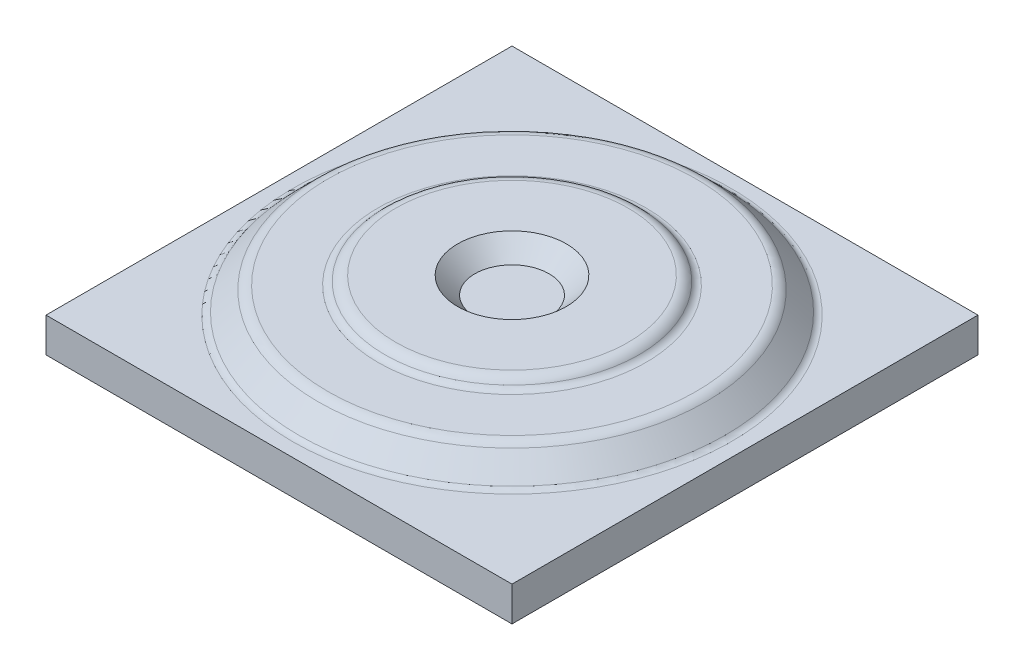
ISO-10303-21;
HEADER;
FILE_DESCRIPTION(('STEP AP214'),'2;1');
FILE_NAME('part.step','',(''),(''),'','','');
FILE_SCHEMA(('AUTOMOTIVE_DESIGN { 1 0 10303 214 1 1 1 1 }'));
ENDSEC;
DATA;
#1=APPLICATION_CONTEXT('core data for automotive mechanical design processes');
#2=APPLICATION_PROTOCOL_DEFINITION('international standard','automotive_design',2000,#1);
#3=PRODUCT_CONTEXT('',#1,'mechanical');
#4=PRODUCT('Part','Part','',(#3));
#5=PRODUCT_RELATED_PRODUCT_CATEGORY('part','',(#4));
#6=PRODUCT_DEFINITION_FORMATION('','',#4);
#7=PRODUCT_DEFINITION_CONTEXT('part definition',#1,'design');
#8=PRODUCT_DEFINITION('design','',#6,#7);
#9=PRODUCT_DEFINITION_SHAPE('','',#8);
#10=(LENGTH_UNIT() NAMED_UNIT(*) SI_UNIT(.MILLI.,.METRE.));
#11=(NAMED_UNIT(*) PLANE_ANGLE_UNIT() SI_UNIT($,.RADIAN.));
#12=(NAMED_UNIT(*) SI_UNIT($,.STERADIAN.) SOLID_ANGLE_UNIT());
#13=UNCERTAINTY_MEASURE_WITH_UNIT(LENGTH_MEASURE(1.E-05),#10,'distance_accuracy_value','');
#14=(GEOMETRIC_REPRESENTATION_CONTEXT(3) GLOBAL_UNCERTAINTY_ASSIGNED_CONTEXT((#13)) GLOBAL_UNIT_ASSIGNED_CONTEXT((#10,
#11,#12)) REPRESENTATION_CONTEXT('',''));
#15=CARTESIAN_POINT('',(0.,0.,0.));
#16=DIRECTION('',(0.,0.,1.));
#17=DIRECTION('',(1.,0.,0.));
#18=AXIS2_PLACEMENT_3D('',#15,#16,#17);
#19=CARTESIAN_POINT('',(-135.,20.,135.));
#20=DIRECTION('',(1.,0.,0.));
#21=DIRECTION('',(0.,0.,-1.));
#22=AXIS2_PLACEMENT_3D('',#19,#20,#21);
#23=PLANE('',#22);
#24=DIRECTION('',(0.,0.,1.));
#25=VECTOR('',#24,1.);
#26=CARTESIAN_POINT('',(-135.,0.,135.));
#27=LINE('',#26,#25);
#28=CARTESIAN_POINT('',(-135.,0.,-135.));
#29=VERTEX_POINT('',#28);
#30=CARTESIAN_POINT('',(-135.,0.,135.));
#31=VERTEX_POINT('',#30);
#32=EDGE_CURVE('E106',#29,#31,#27,.T.);
#33=ORIENTED_EDGE('',*,*,#32,.T.);
#34=DIRECTION('',(0.,-1.,0.));
#35=VECTOR('',#34,1.);
#36=CARTESIAN_POINT('',(-135.,20.,135.));
#37=LINE('',#36,#35);
#38=CARTESIAN_POINT('',(-135.,20.,135.));
#39=VERTEX_POINT('',#38);
#40=EDGE_CURVE('E97',#39,#31,#37,.T.);
#41=ORIENTED_EDGE('',*,*,#40,.F.);
#42=DIRECTION('',(0.,0.,1.));
#43=VECTOR('',#42,1.);
#44=CARTESIAN_POINT('',(-135.,20.,135.));
#45=LINE('',#44,#43);
#46=CARTESIAN_POINT('',(-135.,20.,-135.));
#47=VERTEX_POINT('',#46);
#48=EDGE_CURVE('E91',#47,#39,#45,.T.);
#49=ORIENTED_EDGE('',*,*,#48,.F.);
#50=DIRECTION('',(0.,-1.,0.));
#51=VECTOR('',#50,1.);
#52=CARTESIAN_POINT('',(-135.,20.,-135.));
#53=LINE('',#52,#51);
#54=EDGE_CURVE('E102',#47,#29,#53,.T.);
#55=ORIENTED_EDGE('',*,*,#54,.T.);
#56=EDGE_LOOP('',(#33,#41,#49,#55));
#57=FACE_BOUND('',#56,.T.);
#58=ADVANCED_FACE('F38',(#57),#23,.F.);
#59=CARTESIAN_POINT('',(135.,20.,135.));
#60=DIRECTION('',(0.,0.,-1.));
#61=DIRECTION('',(-1.,0.,0.));
#62=AXIS2_PLACEMENT_3D('',#59,#60,#61);
#63=PLANE('',#62);
#64=DIRECTION('',(1.,0.,0.));
#65=VECTOR('',#64,1.);
#66=CARTESIAN_POINT('',(135.,0.,135.));
#67=LINE('',#66,#65);
#68=CARTESIAN_POINT('',(135.,0.,135.));
#69=VERTEX_POINT('',#68);
#70=EDGE_CURVE('E96',#31,#69,#67,.T.);
#71=ORIENTED_EDGE('',*,*,#70,.T.);
#72=DIRECTION('',(0.,-1.,0.));
#73=VECTOR('',#72,1.);
#74=CARTESIAN_POINT('',(135.,20.,135.));
#75=LINE('',#74,#73);
#76=CARTESIAN_POINT('',(135.,20.,135.));
#77=VERTEX_POINT('',#76);
#78=EDGE_CURVE('E94',#77,#69,#75,.T.);
#79=ORIENTED_EDGE('',*,*,#78,.F.);
#80=DIRECTION('',(1.,0.,0.));
#81=VECTOR('',#80,1.);
#82=CARTESIAN_POINT('',(135.,20.,135.));
#83=LINE('',#82,#81);
#84=EDGE_CURVE('E86',#39,#77,#83,.T.);
#85=ORIENTED_EDGE('',*,*,#84,.F.);
#86=ORIENTED_EDGE('',*,*,#40,.T.);
#87=EDGE_LOOP('',(#71,#79,#85,#86));
#88=FACE_BOUND('',#87,.T.);
#89=ADVANCED_FACE('F95',(#88),#63,.F.);
#90=CARTESIAN_POINT('',(135.,20.,135.));
#91=DIRECTION('',(-1.,0.,0.));
#92=DIRECTION('',(0.,0.,1.));
#93=AXIS2_PLACEMENT_3D('',#90,#91,#92);
#94=PLANE('',#93);
#95=DIRECTION('',(0.,0.,-1.));
#96=VECTOR('',#95,1.);
#97=CARTESIAN_POINT('',(135.,0.,135.));
#98=LINE('',#97,#96);
#99=CARTESIAN_POINT('',(135.,0.,-135.));
#100=VERTEX_POINT('',#99);
#101=EDGE_CURVE('E72',#69,#100,#98,.T.);
#102=ORIENTED_EDGE('',*,*,#101,.T.);
#103=DIRECTION('',(0.,-1.,0.));
#104=VECTOR('',#103,1.);
#105=CARTESIAN_POINT('',(135.,20.,-135.));
#106=LINE('',#105,#104);
#107=CARTESIAN_POINT('',(135.,20.,-135.));
#108=VERTEX_POINT('',#107);
#109=EDGE_CURVE('E98',#108,#100,#106,.T.);
#110=ORIENTED_EDGE('',*,*,#109,.F.);
#111=DIRECTION('',(0.,0.,-1.));
#112=VECTOR('',#111,1.);
#113=CARTESIAN_POINT('',(135.,20.,135.));
#114=LINE('',#113,#112);
#115=EDGE_CURVE('E89',#77,#108,#114,.T.);
#116=ORIENTED_EDGE('',*,*,#115,.F.);
#117=ORIENTED_EDGE('',*,*,#78,.T.);
#118=EDGE_LOOP('',(#102,#110,#116,#117));
#119=FACE_BOUND('',#118,.T.);
#120=ADVANCED_FACE('F100',(#119),#94,.F.);
#121=CARTESIAN_POINT('',(135.,20.,-135.));
#122=DIRECTION('',(0.,0.,1.));
#123=DIRECTION('',(1.,0.,0.));
#124=AXIS2_PLACEMENT_3D('',#121,#122,#123);
#125=PLANE('',#124);
#126=DIRECTION('',(-1.,0.,0.));
#127=VECTOR('',#126,1.);
#128=CARTESIAN_POINT('',(135.,0.,-135.));
#129=LINE('',#128,#127);
#130=EDGE_CURVE('E78',#100,#29,#129,.T.);
#131=ORIENTED_EDGE('',*,*,#130,.T.);
#132=ORIENTED_EDGE('',*,*,#54,.F.);
#133=DIRECTION('',(-1.,0.,0.));
#134=VECTOR('',#133,1.);
#135=CARTESIAN_POINT('',(135.,20.,-135.));
#136=LINE('',#135,#134);
#137=EDGE_CURVE('E55',#108,#47,#136,.T.);
#138=ORIENTED_EDGE('',*,*,#137,.F.);
#139=ORIENTED_EDGE('',*,*,#109,.T.);
#140=EDGE_LOOP('',(#131,#132,#138,#139));
#141=FACE_BOUND('',#140,.T.);
#142=ADVANCED_FACE('F191',(#141),#125,.F.);
#143=CARTESIAN_POINT('',(0.,20.,0.));
#144=DIRECTION('',(0.,1.,0.));
#145=DIRECTION('',(0.,0.,1.));
#146=AXIS2_PLACEMENT_3D('',#143,#144,#145);
#147=PLANE('',#146);
#148=CARTESIAN_POINT('',(0.,20.,0.));
#149=DIRECTION('',(0.,1.,0.));
#150=DIRECTION('',(0.,0.,1.));
#151=AXIS2_PLACEMENT_3D('',#148,#149,#150);
#152=CIRCLE('',#151,127.071067811865);
#153=CARTESIAN_POINT('',(0.,20.,127.071067811865));
#154=VERTEX_POINT('',#153);
#155=EDGE_CURVE('E116',#154,#154,#152,.F.);
#156=ORIENTED_EDGE('',*,*,#155,.T.);
#157=EDGE_LOOP('',(#156));
#158=FACE_BOUND('',#157,.T.);
#159=ORIENTED_EDGE('',*,*,#48,.T.);
#160=ORIENTED_EDGE('',*,*,#84,.T.);
#161=ORIENTED_EDGE('',*,*,#115,.T.);
#162=ORIENTED_EDGE('',*,*,#137,.T.);
#163=EDGE_LOOP('',(#159,#160,#161,#162));
#164=FACE_BOUND('',#163,.T.);
#165=ADVANCED_FACE('F87',(#158,#164),#147,.T.);
#166=CARTESIAN_POINT('',(0.,0.,0.));
#167=DIRECTION('',(0.,1.,0.));
#168=DIRECTION('',(0.,0.,1.));
#169=AXIS2_PLACEMENT_3D('',#166,#167,#168);
#170=PLANE('',#169);
#171=ORIENTED_EDGE('',*,*,#32,.F.);
#172=ORIENTED_EDGE('',*,*,#130,.F.);
#173=ORIENTED_EDGE('',*,*,#101,.F.);
#174=ORIENTED_EDGE('',*,*,#70,.F.);
#175=EDGE_LOOP('',(#171,#172,#173,#174));
#176=FACE_BOUND('',#175,.T.);
#177=ADVANCED_FACE('F208',(#176),#170,.F.);
#178=CARTESIAN_POINT('',(0.,20.,0.));
#179=DIRECTION('',(0.,-1.,0.));
#180=DIRECTION('',(0.,0.,-1.));
#181=AXIS2_PLACEMENT_3D('',#178,#179,#180);
#182=CONICAL_SURFACE('',#181,125.,0.785398163397452);
#183=CARTESIAN_POINT('',(0.,32.6568542494925,0.));
#184=DIRECTION('',(0.,1.,0.));
#185=DIRECTION('',(0.,0.,1.));
#186=AXIS2_PLACEMENT_3D('',#183,#184,#185);
#187=CIRCLE('',#186,112.343145750507);
#188=CARTESIAN_POINT('',(0.,32.6568542494925,112.343145750507));
#189=VERTEX_POINT('',#188);
#190=EDGE_CURVE('E125',#189,#189,#187,.F.);
#191=ORIENTED_EDGE('',*,*,#190,.T.);
#192=EDGE_LOOP('',(#191));
#193=FACE_BOUND('',#192,.T.);
#194=CARTESIAN_POINT('',(0.,21.4644660940673,0.));
#195=DIRECTION('',(0.,-1.,0.));
#196=DIRECTION('',(0.,0.,-1.));
#197=AXIS2_PLACEMENT_3D('',#194,#195,#196);
#198=CIRCLE('',#197,123.535533905933);
#199=CARTESIAN_POINT('',(0.,21.4644660940673,-123.535533905933));
#200=VERTEX_POINT('',#199);
#201=EDGE_CURVE('E119',#200,#200,#198,.F.);
#202=ORIENTED_EDGE('',*,*,#201,.T.);
#203=EDGE_LOOP('',(#202));
#204=FACE_BOUND('',#203,.T.);
#205=ADVANCED_FACE('F218',(#193,#204),#182,.T.);
#206=CARTESIAN_POINT('',(110.,35.0000000000001,0.));
#207=DIRECTION('',(0.,1.,0.));
#208=DIRECTION('',(0.,0.,1.));
#209=AXIS2_PLACEMENT_3D('',#206,#207,#208);
#210=PLANE('',#209);
#211=CARTESIAN_POINT('',(0.,35.0000000000001,0.));
#212=DIRECTION('',(0.,1.,0.));
#213=DIRECTION('',(0.,0.,1.));
#214=AXIS2_PLACEMENT_3D('',#211,#212,#213);
#215=CIRCLE('',#214,106.686291501015);
#216=CARTESIAN_POINT('',(0.,35.0000000000001,106.686291501015));
#217=VERTEX_POINT('',#216);
#218=EDGE_CURVE('E128',#217,#217,#215,.T.);
#219=ORIENTED_EDGE('',*,*,#218,.T.);
#220=EDGE_LOOP('',(#219));
#221=FACE_BOUND('',#220,.T.);
#222=CARTESIAN_POINT('',(0.,35.0000000000001,0.));
#223=DIRECTION('',(0.,1.,0.));
#224=DIRECTION('',(0.,0.,1.));
#225=AXIS2_PLACEMENT_3D('',#222,#223,#224);
#226=CIRCLE('',#225,77.6028352527586);
#227=CARTESIAN_POINT('',(0.,35.0000000000001,77.6028352527586));
#228=VERTEX_POINT('',#227);
#229=EDGE_CURVE('E122',#228,#228,#226,.F.);
#230=ORIENTED_EDGE('',*,*,#229,.T.);
#231=EDGE_LOOP('',(#230));
#232=FACE_BOUND('',#231,.T.);
#233=ADVANCED_FACE('F229',(#221,#232),#210,.T.);
#234=CARTESIAN_POINT('',(71.4989623089513,40.,0.));
#235=DIRECTION('',(0.,1.,0.));
#236=DIRECTION('',(0.,0.,1.));
#237=AXIS2_PLACEMENT_3D('',#234,#235,#236);
#238=PLANE('',#237);
#239=CARTESIAN_POINT('',(0.,40.,0.));
#240=DIRECTION('',(0.,1.,0.));
#241=DIRECTION('',(0.,0.,1.));
#242=AXIS2_PLACEMENT_3D('',#239,#240,#241);
#243=CIRCLE('',#242,67.355884486799);
#244=CARTESIAN_POINT('',(0.,40.,67.355884486799));
#245=VERTEX_POINT('',#244);
#246=EDGE_CURVE('E12',#245,#245,#243,.T.);
#247=ORIENTED_EDGE('',*,*,#246,.T.);
#248=EDGE_LOOP('',(#247));
#249=FACE_BOUND('',#248,.T.);
#250=CARTESIAN_POINT('',(0.,40.,0.));
#251=DIRECTION('',(0.,-1.,0.));
#252=DIRECTION('',(0.,0.,-1.));
#253=AXIS2_PLACEMENT_3D('',#250,#251,#252);
#254=CIRCLE('',#253,31.4989623089513);
#255=CARTESIAN_POINT('',(0.,40.,-31.4989623089513));
#256=VERTEX_POINT('',#255);
#257=EDGE_CURVE('E109',#256,#256,#254,.T.);
#258=ORIENTED_EDGE('',*,*,#257,.T.);
#259=EDGE_LOOP('',(#258));
#260=FACE_BOUND('',#259,.T.);
#261=ADVANCED_FACE('F237',(#249,#260),#238,.T.);
#262=CARTESIAN_POINT('',(0.,40.,0.));
#263=DIRECTION('',(0.,1.,0.));
#264=DIRECTION('',(0.,0.,1.));
#265=AXIS2_PLACEMENT_3D('',#262,#263,#264);
#266=CONICAL_SURFACE('',#265,31.4989623089513,0.785398163397442);
#267=CARTESIAN_POINT('',(0.,30.,0.));
#268=DIRECTION('',(0.,-1.,0.));
#269=DIRECTION('',(0.,0.,-1.));
#270=AXIS2_PLACEMENT_3D('',#267,#268,#269);
#271=CIRCLE('',#270,21.4989623089514);
#272=CARTESIAN_POINT('',(0.,30.,-21.4989623089514));
#273=VERTEX_POINT('',#272);
#274=EDGE_CURVE('E307',#273,#273,#271,.T.);
#275=ORIENTED_EDGE('',*,*,#274,.T.);
#276=EDGE_LOOP('',(#275));
#277=FACE_BOUND('',#276,.T.);
#278=ORIENTED_EDGE('',*,*,#257,.F.);
#279=EDGE_LOOP('',(#278));
#280=FACE_BOUND('',#279,.T.);
#281=ADVANCED_FACE('F245',(#277,#280),#266,.F.);
#282=CARTESIAN_POINT('',(21.4989623089514,30.,0.));
#283=DIRECTION('',(0.,1.,0.));
#284=DIRECTION('',(0.,0.,1.));
#285=AXIS2_PLACEMENT_3D('',#282,#283,#284);
#286=PLANE('',#285);
#287=ORIENTED_EDGE('',*,*,#274,.F.);
#288=EDGE_LOOP('',(#287));
#289=FACE_BOUND('',#288,.T.);
#290=ADVANCED_FACE('F156',(#289),#286,.T.);
#291=CARTESIAN_POINT('',(0.,25.,0.));
#292=DIRECTION('',(0.,1.,0.));
#293=DIRECTION('',(0.,0.,1.));
#294=AXIS2_PLACEMENT_3D('',#291,#292,#293);
#295=TOROIDAL_SURFACE('',#294,127.071067811865,5.);
#296=ORIENTED_EDGE('',*,*,#201,.F.);
#297=EDGE_LOOP('',(#296));
#298=FACE_BOUND('',#297,.T.);
#299=ORIENTED_EDGE('',*,*,#155,.F.);
#300=EDGE_LOOP('',(#299));
#301=FACE_BOUND('',#300,.T.);
#302=ADVANCED_FACE('F153',(#298,#301),#295,.F.);
#303=CARTESIAN_POINT('',(0.,40.0000000000001,0.));
#304=DIRECTION('',(0.,1.,0.));
#305=DIRECTION('',(0.,0.,1.));
#306=AXIS2_PLACEMENT_3D('',#303,#304,#305);
#307=TOROIDAL_SURFACE('',#306,77.6028352527586,5.);
#308=CARTESIAN_POINT('',(0.,36.923076923077,0.));
#309=DIRECTION('',(0.,1.,0.));
#310=DIRECTION('',(0.,0.,1.));
#311=AXIS2_PLACEMENT_3D('',#308,#309,#310);
#312=CIRCLE('',#311,73.6617003427741);
#313=CARTESIAN_POINT('',(0.,36.923076923077,73.6617003427741));
#314=VERTEX_POINT('',#313);
#315=EDGE_CURVE('E47',#314,#314,#312,.F.);
#316=ORIENTED_EDGE('',*,*,#315,.T.);
#317=EDGE_LOOP('',(#316));
#318=FACE_BOUND('',#317,.T.);
#319=ORIENTED_EDGE('',*,*,#229,.F.);
#320=EDGE_LOOP('',(#319));
#321=FACE_BOUND('',#320,.T.);
#322=ADVANCED_FACE('F133',(#318,#321),#307,.F.);
#323=CARTESIAN_POINT('',(0.,27.0000000000001,0.));
#324=DIRECTION('',(0.,1.,0.));
#325=DIRECTION('',(0.,0.,1.));
#326=AXIS2_PLACEMENT_3D('',#323,#324,#325);
#327=TOROIDAL_SURFACE('',#326,106.686291501015,8.);
#328=ORIENTED_EDGE('',*,*,#218,.F.);
#329=EDGE_LOOP('',(#328));
#330=FACE_BOUND('',#329,.T.);
#331=ORIENTED_EDGE('',*,*,#190,.F.);
#332=EDGE_LOOP('',(#331));
#333=FACE_BOUND('',#332,.T.);
#334=ADVANCED_FACE('F137',(#330,#333),#327,.T.);
#335=CARTESIAN_POINT('',(0.,32.,0.));
#336=DIRECTION('',(0.,-1.,0.));
#337=DIRECTION('',(0.,0.,-1.));
#338=AXIS2_PLACEMENT_3D('',#335,#336,#337);
#339=TOROIDAL_SURFACE('',#338,67.355884486799,8.);
#340=ORIENTED_EDGE('',*,*,#246,.F.);
#341=EDGE_LOOP('',(#340));
#342=FACE_BOUND('',#341,.T.);
#343=ORIENTED_EDGE('',*,*,#315,.F.);
#344=EDGE_LOOP('',(#343));
#345=FACE_BOUND('',#344,.T.);
#346=ADVANCED_FACE('F40',(#342,#345),#339,.T.);
#347=CLOSED_SHELL('',(#58,#89,#120,#142,#165,#177,#205,#233,#261,#281,#290,#302,#322,#334,#346));
#348=MANIFOLD_SOLID_BREP('B2',#347);
#349=ADVANCED_BREP_SHAPE_REPRESENTATION('',(#18,#348),#14);
#350=SHAPE_DEFINITION_REPRESENTATION(#9,#349);
ENDSEC;
END-ISO-10303-21;
